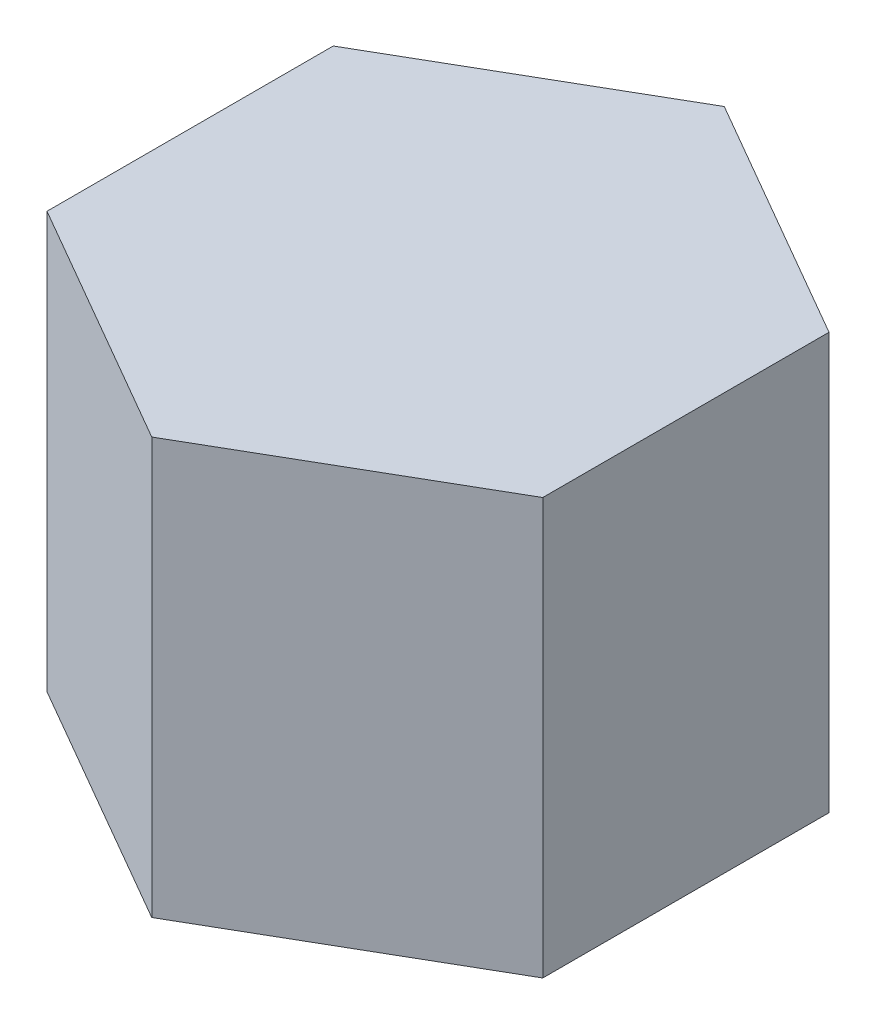
ISO-10303-21;
HEADER;
FILE_DESCRIPTION(('STEP AP214'),'2;1');
FILE_NAME('part.step','',(''),(''),'','','');
FILE_SCHEMA(('AUTOMOTIVE_DESIGN { 1 0 10303 214 1 1 1 1 }'));
ENDSEC;
DATA;
#1=APPLICATION_CONTEXT('core data for automotive mechanical design processes');
#2=APPLICATION_PROTOCOL_DEFINITION('international standard','automotive_design',2000,#1);
#3=PRODUCT_CONTEXT('',#1,'mechanical');
#4=PRODUCT('Part','Part','',(#3));
#5=PRODUCT_RELATED_PRODUCT_CATEGORY('part','',(#4));
#6=PRODUCT_DEFINITION_FORMATION('','',#4);
#7=PRODUCT_DEFINITION_CONTEXT('part definition',#1,'design');
#8=PRODUCT_DEFINITION('design','',#6,#7);
#9=PRODUCT_DEFINITION_SHAPE('','',#8);
#10=(LENGTH_UNIT() NAMED_UNIT(*) SI_UNIT(.MILLI.,.METRE.));
#11=(NAMED_UNIT(*) PLANE_ANGLE_UNIT() SI_UNIT($,.RADIAN.));
#12=(NAMED_UNIT(*) SI_UNIT($,.STERADIAN.) SOLID_ANGLE_UNIT());
#13=UNCERTAINTY_MEASURE_WITH_UNIT(LENGTH_MEASURE(1.E-05),#10,'distance_accuracy_value','');
#14=(GEOMETRIC_REPRESENTATION_CONTEXT(3) GLOBAL_UNCERTAINTY_ASSIGNED_CONTEXT((#13)) GLOBAL_UNIT_ASSIGNED_CONTEXT((#10,
#11,#12)) REPRESENTATION_CONTEXT('',''));
#15=CARTESIAN_POINT('',(0.,0.,0.));
#16=DIRECTION('',(0.,0.,1.));
#17=DIRECTION('',(1.,0.,0.));
#18=AXIS2_PLACEMENT_3D('',#15,#16,#17);
#19=CARTESIAN_POINT('',(202.839551417382,-147.556598747966,290.81594581671));
#20=DIRECTION('',(-0.500000000000096,0.,-0.866025403784383));
#21=DIRECTION('',(-0.866025403784383,0.,0.500000000000096));
#22=AXIS2_PLACEMENT_3D('',#19,#20,#21);
#23=PLANE('',#22);
#24=CARTESIAN_POINT('',(203.142660308706,-147.047793579175,290.64094581671));
#25=DIRECTION('',(-0.866025403784383,0.,0.500000000000096));
#26=VECTOR('',#25,1.);
#27=LINE('',#24,#26);
#28=CARTESIAN_POINT('',(203.142660308706,-147.047793579175,290.64094581671));
#29=VERTEX_POINT('',#28);
#30=CARTESIAN_POINT('',(202.839551417382,-147.047793579175,290.81594581671));
#31=VERTEX_POINT('',#30);
#32=EDGE_CURVE('E170',#29,#31,#27,.T.);
#33=ORIENTED_EDGE('',*,*,#32,.T.);
#34=CARTESIAN_POINT('',(202.839551417382,-147.556598747966,290.81594581671));
#35=DIRECTION('',(0.,1.,0.));
#36=VECTOR('',#35,1.);
#37=LINE('',#34,#36);
#38=CARTESIAN_POINT('',(202.839551417382,-147.556598747966,290.81594581671));
#39=VERTEX_POINT('',#38);
#40=EDGE_CURVE('E35',#39,#31,#37,.T.);
#41=ORIENTED_EDGE('',*,*,#40,.F.);
#42=CARTESIAN_POINT('',(203.142660308706,-147.556598747966,290.64094581671));
#43=DIRECTION('',(-0.866025403784383,0.,0.500000000000096));
#44=VECTOR('',#43,1.);
#45=LINE('',#42,#44);
#46=CARTESIAN_POINT('',(203.142660308706,-147.556598747966,290.64094581671));
#47=VERTEX_POINT('',#46);
#48=EDGE_CURVE('E159',#47,#39,#45,.T.);
#49=ORIENTED_EDGE('',*,*,#48,.F.);
#50=CARTESIAN_POINT('',(203.142660308706,-147.556598747966,290.64094581671));
#51=DIRECTION('',(0.,1.,0.));
#52=VECTOR('',#51,1.);
#53=LINE('',#50,#52);
#54=EDGE_CURVE('E10',#47,#29,#53,.T.);
#55=ORIENTED_EDGE('',*,*,#54,.T.);
#56=EDGE_LOOP('',(#33,#41,#49,#55));
#57=FACE_BOUND('',#56,.T.);
#58=ADVANCED_FACE('F16',(#57),#23,.F.);
#59=CARTESIAN_POINT('',(203.142660308706,-147.556598747966,291.594471220494));
#60=DIRECTION('',(-1.,0.,0.));
#61=DIRECTION('',(0.,-1.,0.));
#62=AXIS2_PLACEMENT_3D('',#59,#60,#61);
#63=PLANE('',#62);
#64=CARTESIAN_POINT('',(203.142660308706,-147.047793579175,290.29094581671));
#65=DIRECTION('',(0.,0.,1.));
#66=VECTOR('',#65,1.);
#67=LINE('',#64,#66);
#68=CARTESIAN_POINT('',(203.142660308706,-147.047793579175,290.29094581671));
#69=VERTEX_POINT('',#68);
#70=EDGE_CURVE('E167',#69,#29,#67,.T.);
#71=ORIENTED_EDGE('',*,*,#70,.T.);
#72=ORIENTED_EDGE('',*,*,#54,.F.);
#73=CARTESIAN_POINT('',(203.142660308706,-147.556598747966,290.29094581671));
#74=DIRECTION('',(0.,0.,1.));
#75=VECTOR('',#74,1.);
#76=LINE('',#73,#75);
#77=CARTESIAN_POINT('',(203.142660308706,-147.556598747966,290.29094581671));
#78=VERTEX_POINT('',#77);
#79=EDGE_CURVE('E156',#78,#47,#76,.T.);
#80=ORIENTED_EDGE('',*,*,#79,.F.);
#81=CARTESIAN_POINT('',(203.142660308706,-147.556598747966,290.29094581671));
#82=DIRECTION('',(0.,1.,0.));
#83=VECTOR('',#82,1.);
#84=LINE('',#81,#83);
#85=EDGE_CURVE('E27',#78,#69,#84,.T.);
#86=ORIENTED_EDGE('',*,*,#85,.T.);
#87=EDGE_LOOP('',(#71,#72,#80,#86));
#88=FACE_BOUND('',#87,.T.);
#89=ADVANCED_FACE('F189',(#88),#63,.F.);
#90=CARTESIAN_POINT('',(203.142660308706,-147.556598747966,290.29094581671));
#91=DIRECTION('',(-0.499999999999943,0.,0.866025403784471));
#92=DIRECTION('',(0.866025403784471,0.,0.499999999999943));
#93=AXIS2_PLACEMENT_3D('',#90,#91,#92);
#94=PLANE('',#93);
#95=CARTESIAN_POINT('',(202.839551417381,-147.047793579175,290.11594581671));
#96=DIRECTION('',(0.866025403784471,0.,0.499999999999943));
#97=VECTOR('',#96,1.);
#98=LINE('',#95,#97);
#99=CARTESIAN_POINT('',(202.839551417382,-147.047793579175,290.11594581671));
#100=VERTEX_POINT('',#99);
#101=EDGE_CURVE('E163',#100,#69,#98,.T.);
#102=ORIENTED_EDGE('',*,*,#101,.T.);
#103=ORIENTED_EDGE('',*,*,#85,.F.);
#104=CARTESIAN_POINT('',(202.839551417381,-147.556598747966,290.11594581671));
#105=DIRECTION('',(0.866025403784471,0.,0.499999999999943));
#106=VECTOR('',#105,1.);
#107=LINE('',#104,#106);
#108=CARTESIAN_POINT('',(202.839551417382,-147.556598747966,290.11594581671));
#109=VERTEX_POINT('',#108);
#110=EDGE_CURVE('E106',#109,#78,#107,.T.);
#111=ORIENTED_EDGE('',*,*,#110,.F.);
#112=CARTESIAN_POINT('',(202.839551417381,-147.556598747966,290.11594581671));
#113=DIRECTION('',(0.,1.,0.));
#114=VECTOR('',#113,1.);
#115=LINE('',#112,#114);
#116=EDGE_CURVE('E94',#109,#100,#115,.T.);
#117=ORIENTED_EDGE('',*,*,#116,.T.);
#118=EDGE_LOOP('',(#102,#103,#111,#117));
#119=FACE_BOUND('',#118,.T.);
#120=ADVANCED_FACE('F198',(#119),#94,.F.);
#121=CARTESIAN_POINT('',(202.839551417382,-147.556598747966,290.11594581671));
#122=DIRECTION('',(0.500000000000096,0.,0.866025403784383));
#123=DIRECTION('',(0.866025403784383,0.,-0.500000000000096));
#124=AXIS2_PLACEMENT_3D('',#121,#122,#123);
#125=PLANE('',#124);
#126=CARTESIAN_POINT('',(202.536442526057,-147.047793579175,290.29094581671));
#127=DIRECTION('',(0.866025403784383,0.,-0.500000000000096));
#128=VECTOR('',#127,1.);
#129=LINE('',#126,#128);
#130=CARTESIAN_POINT('',(202.536442526057,-147.047793579175,290.29094581671));
#131=VERTEX_POINT('',#130);
#132=EDGE_CURVE('E162',#131,#100,#129,.T.);
#133=ORIENTED_EDGE('',*,*,#132,.T.);
#134=ORIENTED_EDGE('',*,*,#116,.F.);
#135=CARTESIAN_POINT('',(202.536442526057,-147.556598747966,290.29094581671));
#136=DIRECTION('',(0.866025403784383,0.,-0.500000000000096));
#137=VECTOR('',#136,1.);
#138=LINE('',#135,#137);
#139=CARTESIAN_POINT('',(202.536442526057,-147.556598747966,290.29094581671));
#140=VERTEX_POINT('',#139);
#141=EDGE_CURVE('E98',#140,#109,#138,.T.);
#142=ORIENTED_EDGE('',*,*,#141,.F.);
#143=CARTESIAN_POINT('',(202.536442526057,-147.556598747966,290.29094581671));
#144=DIRECTION('',(0.,1.,0.));
#145=VECTOR('',#144,1.);
#146=LINE('',#143,#145);
#147=EDGE_CURVE('E79',#140,#131,#146,.T.);
#148=ORIENTED_EDGE('',*,*,#147,.T.);
#149=EDGE_LOOP('',(#133,#134,#142,#148));
#150=FACE_BOUND('',#149,.T.);
#151=ADVANCED_FACE('F100',(#150),#125,.F.);
#152=CARTESIAN_POINT('',(202.536442526057,-147.556598747966,291.594471220494));
#153=DIRECTION('',(1.,0.,0.));
#154=DIRECTION('',(0.,1.,0.));
#155=AXIS2_PLACEMENT_3D('',#152,#153,#154);
#156=PLANE('',#155);
#157=CARTESIAN_POINT('',(202.536442526057,-147.047793579175,290.64094581671));
#158=DIRECTION('',(0.,0.,-1.));
#159=VECTOR('',#158,1.);
#160=LINE('',#157,#159);
#161=CARTESIAN_POINT('',(202.536442526057,-147.047793579175,290.64094581671));
#162=VERTEX_POINT('',#161);
#163=EDGE_CURVE('E88',#162,#131,#160,.T.);
#164=ORIENTED_EDGE('',*,*,#163,.T.);
#165=ORIENTED_EDGE('',*,*,#147,.F.);
#166=CARTESIAN_POINT('',(202.536442526057,-147.556598747966,290.64094581671));
#167=DIRECTION('',(0.,0.,-1.));
#168=VECTOR('',#167,1.);
#169=LINE('',#166,#168);
#170=CARTESIAN_POINT('',(202.536442526057,-147.556598747966,290.64094581671));
#171=VERTEX_POINT('',#170);
#172=EDGE_CURVE('E84',#171,#140,#169,.T.);
#173=ORIENTED_EDGE('',*,*,#172,.F.);
#174=CARTESIAN_POINT('',(202.536442526057,-147.556598747966,290.64094581671));
#175=DIRECTION('',(0.,1.,0.));
#176=VECTOR('',#175,1.);
#177=LINE('',#174,#176);
#178=EDGE_CURVE('E58',#171,#162,#177,.T.);
#179=ORIENTED_EDGE('',*,*,#178,.T.);
#180=EDGE_LOOP('',(#164,#165,#173,#179));
#181=FACE_BOUND('',#180,.T.);
#182=ADVANCED_FACE('F82',(#181),#156,.F.);
#183=CARTESIAN_POINT('',(202.536442526057,-147.556598747966,290.64094581671));
#184=DIRECTION('',(0.500000000000062,0.,-0.866025403784403));
#185=DIRECTION('',(-0.866025403784403,0.,-0.500000000000062));
#186=AXIS2_PLACEMENT_3D('',#183,#184,#185);
#187=PLANE('',#186);
#188=CARTESIAN_POINT('',(202.839551417382,-147.047793579175,290.81594581671));
#189=DIRECTION('',(-0.866025403784403,0.,-0.500000000000062));
#190=VECTOR('',#189,1.);
#191=LINE('',#188,#190);
#192=EDGE_CURVE('E160',#31,#162,#191,.T.);
#193=ORIENTED_EDGE('',*,*,#192,.T.);
#194=ORIENTED_EDGE('',*,*,#178,.F.);
#195=CARTESIAN_POINT('',(202.839551417382,-147.556598747966,290.81594581671));
#196=DIRECTION('',(-0.866025403784403,0.,-0.500000000000062));
#197=VECTOR('',#196,1.);
#198=LINE('',#195,#197);
#199=EDGE_CURVE('E112',#39,#171,#198,.T.);
#200=ORIENTED_EDGE('',*,*,#199,.F.);
#201=ORIENTED_EDGE('',*,*,#40,.T.);
#202=EDGE_LOOP('',(#193,#194,#200,#201));
#203=FACE_BOUND('',#202,.T.);
#204=ADVANCED_FACE('F131',(#203),#187,.F.);
#205=CARTESIAN_POINT('',(206.491105863044,-147.556598747966,291.594471220494));
#206=DIRECTION('',(0.,1.,0.));
#207=DIRECTION('',(-1.,0.,0.));
#208=AXIS2_PLACEMENT_3D('',#205,#206,#207);
#209=PLANE('',#208);
#210=ORIENTED_EDGE('',*,*,#48,.T.);
#211=ORIENTED_EDGE('',*,*,#199,.T.);
#212=ORIENTED_EDGE('',*,*,#172,.T.);
#213=ORIENTED_EDGE('',*,*,#141,.T.);
#214=ORIENTED_EDGE('',*,*,#110,.T.);
#215=ORIENTED_EDGE('',*,*,#79,.T.);
#216=EDGE_LOOP('',(#210,#211,#212,#213,#214,#215));
#217=FACE_BOUND('',#216,.T.);
#218=ADVANCED_FACE('F111',(#217),#209,.F.);
#219=CARTESIAN_POINT('',(206.491105863044,-147.047793579175,291.594471220494));
#220=DIRECTION('',(0.,1.,0.));
#221=DIRECTION('',(-1.,0.,0.));
#222=AXIS2_PLACEMENT_3D('',#219,#220,#221);
#223=PLANE('',#222);
#224=ORIENTED_EDGE('',*,*,#32,.F.);
#225=ORIENTED_EDGE('',*,*,#70,.F.);
#226=ORIENTED_EDGE('',*,*,#101,.F.);
#227=ORIENTED_EDGE('',*,*,#132,.F.);
#228=ORIENTED_EDGE('',*,*,#163,.F.);
#229=ORIENTED_EDGE('',*,*,#192,.F.);
#230=EDGE_LOOP('',(#224,#225,#226,#227,#228,#229));
#231=FACE_BOUND('',#230,.T.);
#232=ADVANCED_FACE('F130',(#231),#223,.T.);
#233=CLOSED_SHELL('',(#58,#89,#120,#151,#182,#204,#218,#232));
#234=MANIFOLD_SOLID_BREP('B1',#233);
#235=ADVANCED_BREP_SHAPE_REPRESENTATION('',(#18,#234),#14);
#236=SHAPE_DEFINITION_REPRESENTATION(#9,#235);
ENDSEC;
END-ISO-10303-21;
